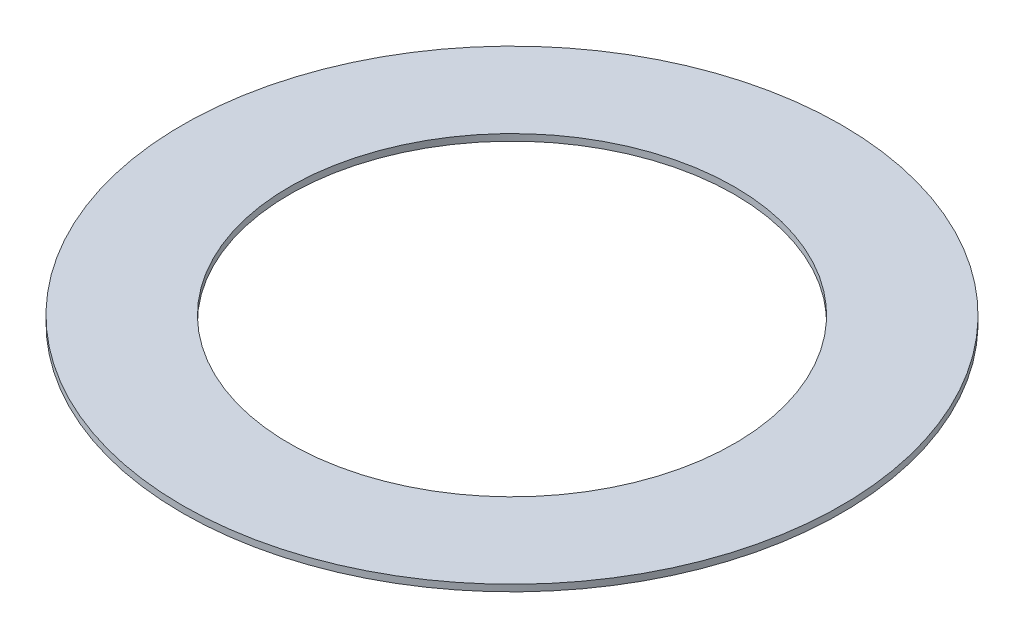
ISO-10303-21;
HEADER;
FILE_DESCRIPTION(('STEP AP214'),'2;1');
FILE_NAME('part.step','',(''),(''),'','','');
FILE_SCHEMA(('AUTOMOTIVE_DESIGN { 1 0 10303 214 1 1 1 1 }'));
ENDSEC;
DATA;
#1=APPLICATION_CONTEXT('core data for automotive mechanical design processes');
#2=APPLICATION_PROTOCOL_DEFINITION('international standard','automotive_design',2000,#1);
#3=PRODUCT_CONTEXT('',#1,'mechanical');
#4=PRODUCT('Part','Part','',(#3));
#5=PRODUCT_RELATED_PRODUCT_CATEGORY('part','',(#4));
#6=PRODUCT_DEFINITION_FORMATION('','',#4);
#7=PRODUCT_DEFINITION_CONTEXT('part definition',#1,'design');
#8=PRODUCT_DEFINITION('design','',#6,#7);
#9=PRODUCT_DEFINITION_SHAPE('','',#8);
#10=(LENGTH_UNIT() NAMED_UNIT(*) SI_UNIT(.MILLI.,.METRE.));
#11=(NAMED_UNIT(*) PLANE_ANGLE_UNIT() SI_UNIT($,.RADIAN.));
#12=(NAMED_UNIT(*) SI_UNIT($,.STERADIAN.) SOLID_ANGLE_UNIT());
#13=UNCERTAINTY_MEASURE_WITH_UNIT(LENGTH_MEASURE(1.E-05),#10,'distance_accuracy_value','');
#14=(GEOMETRIC_REPRESENTATION_CONTEXT(3) GLOBAL_UNCERTAINTY_ASSIGNED_CONTEXT((#13)) GLOBAL_UNIT_ASSIGNED_CONTEXT((#10,
#11,#12)) REPRESENTATION_CONTEXT('',''));
#15=CARTESIAN_POINT('',(0.,0.,0.));
#16=DIRECTION('',(0.,0.,1.));
#17=DIRECTION('',(1.,0.,0.));
#18=AXIS2_PLACEMENT_3D('',#15,#16,#17);
#19=CARTESIAN_POINT('',(0.,0.,0.));
#20=DIRECTION('',(0.,1.,0.));
#21=DIRECTION('',(0.,0.,1.));
#22=AXIS2_PLACEMENT_3D('',#19,#20,#21);
#23=PLANE('',#22);
#24=CARTESIAN_POINT('',(0.,0.,0.));
#25=DIRECTION('',(0.,-1.,0.));
#26=DIRECTION('',(0.,0.,-1.));
#27=AXIS2_PLACEMENT_3D('',#24,#25,#26);
#28=CIRCLE('',#27,6.75);
#29=CARTESIAN_POINT('',(0.,0.,-6.75));
#30=VERTEX_POINT('',#29);
#31=EDGE_CURVE('E26',#30,#30,#28,.F.);
#32=ORIENTED_EDGE('',*,*,#31,.T.);
#33=EDGE_LOOP('',(#32));
#34=FACE_BOUND('',#33,.T.);
#35=CARTESIAN_POINT('',(0.,0.,0.));
#36=DIRECTION('',(0.,-1.,0.));
#37=DIRECTION('',(0.,0.,-1.));
#38=AXIS2_PLACEMENT_3D('',#35,#36,#37);
#39=CIRCLE('',#38,10.);
#40=CARTESIAN_POINT('',(0.,0.,-10.));
#41=VERTEX_POINT('',#40);
#42=EDGE_CURVE('E17',#41,#41,#39,.F.);
#43=ORIENTED_EDGE('',*,*,#42,.F.);
#44=EDGE_LOOP('',(#43));
#45=FACE_BOUND('',#44,.T.);
#46=ADVANCED_FACE('F14',(#34,#45),#23,.F.);
#47=CARTESIAN_POINT('',(0.,0.2,0.));
#48=DIRECTION('',(0.,-1.,0.));
#49=DIRECTION('',(0.,0.,-1.));
#50=AXIS2_PLACEMENT_3D('',#47,#48,#49);
#51=CYLINDRICAL_SURFACE('',#50,10.);
#52=ORIENTED_EDGE('',*,*,#42,.T.);
#53=EDGE_LOOP('',(#52));
#54=FACE_BOUND('',#53,.T.);
#55=CARTESIAN_POINT('',(0.,0.2,0.));
#56=DIRECTION('',(0.,-1.,0.));
#57=DIRECTION('',(0.,0.,-1.));
#58=AXIS2_PLACEMENT_3D('',#55,#56,#57);
#59=CIRCLE('',#58,10.);
#60=CARTESIAN_POINT('',(0.,0.2,-10.));
#61=VERTEX_POINT('',#60);
#62=EDGE_CURVE('E21',#61,#61,#59,.F.);
#63=ORIENTED_EDGE('',*,*,#62,.F.);
#64=EDGE_LOOP('',(#63));
#65=FACE_BOUND('',#64,.T.);
#66=ADVANCED_FACE('F34',(#54,#65),#51,.T.);
#67=CARTESIAN_POINT('',(0.,0.2,0.));
#68=DIRECTION('',(0.,-1.,0.));
#69=DIRECTION('',(0.,0.,-1.));
#70=AXIS2_PLACEMENT_3D('',#67,#68,#69);
#71=CYLINDRICAL_SURFACE('',#70,6.75);
#72=CARTESIAN_POINT('',(0.,0.2,0.));
#73=DIRECTION('',(0.,-1.,0.));
#74=DIRECTION('',(0.,0.,-1.));
#75=AXIS2_PLACEMENT_3D('',#72,#73,#74);
#76=CIRCLE('',#75,6.75);
#77=CARTESIAN_POINT('',(0.,0.2,-6.75));
#78=VERTEX_POINT('',#77);
#79=EDGE_CURVE('E10',#78,#78,#76,.T.);
#80=ORIENTED_EDGE('',*,*,#79,.F.);
#81=EDGE_LOOP('',(#80));
#82=FACE_BOUND('',#81,.T.);
#83=ORIENTED_EDGE('',*,*,#31,.F.);
#84=EDGE_LOOP('',(#83));
#85=FACE_BOUND('',#84,.T.);
#86=ADVANCED_FACE('F42',(#82,#85),#71,.F.);
#87=CARTESIAN_POINT('',(0.,0.2,0.));
#88=DIRECTION('',(0.,1.,0.));
#89=DIRECTION('',(0.,0.,1.));
#90=AXIS2_PLACEMENT_3D('',#87,#88,#89);
#91=PLANE('',#90);
#92=ORIENTED_EDGE('',*,*,#79,.T.);
#93=EDGE_LOOP('',(#92));
#94=FACE_BOUND('',#93,.T.);
#95=ORIENTED_EDGE('',*,*,#62,.T.);
#96=EDGE_LOOP('',(#95));
#97=FACE_BOUND('',#96,.T.);
#98=ADVANCED_FACE('F43',(#94,#97),#91,.T.);
#99=CLOSED_SHELL('',(#46,#66,#86,#98));
#100=MANIFOLD_SOLID_BREP('B1',#99);
#101=ADVANCED_BREP_SHAPE_REPRESENTATION('',(#18,#100),#14);
#102=SHAPE_DEFINITION_REPRESENTATION(#9,#101);
ENDSEC;
END-ISO-10303-21;
